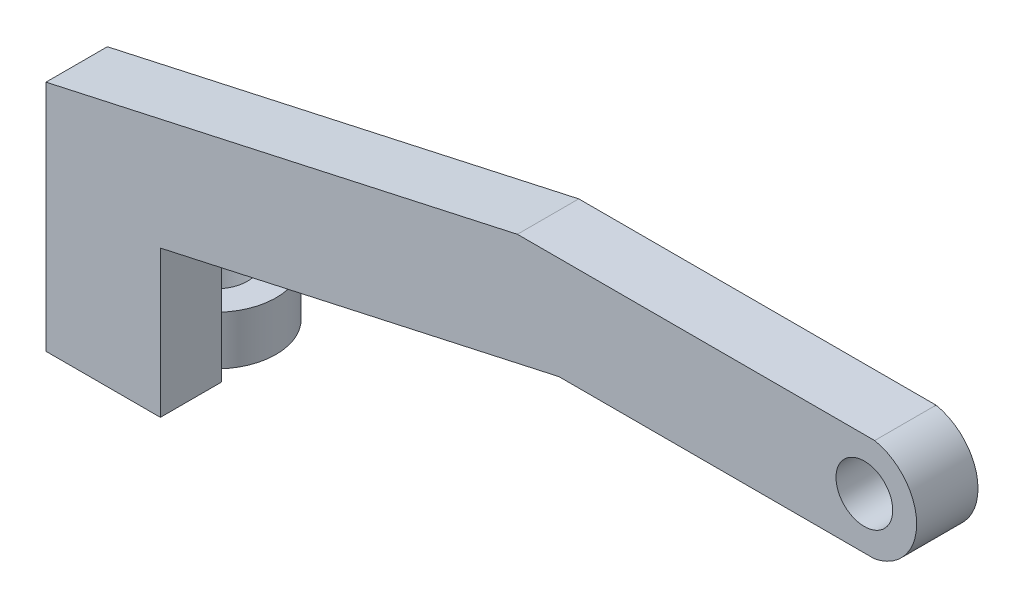
ISO-10303-21;
HEADER;
FILE_DESCRIPTION(('STEP AP214'),'2;1');
FILE_NAME('part.step','',(''),(''),'','','');
FILE_SCHEMA(('AUTOMOTIVE_DESIGN { 1 0 10303 214 1 1 1 1 }'));
ENDSEC;
DATA;
#1=APPLICATION_CONTEXT('core data for automotive mechanical design processes');
#2=APPLICATION_PROTOCOL_DEFINITION('international standard','automotive_design',2000,#1);
#3=PRODUCT_CONTEXT('',#1,'mechanical');
#4=PRODUCT('Part','Part','',(#3));
#5=PRODUCT_RELATED_PRODUCT_CATEGORY('part','',(#4));
#6=PRODUCT_DEFINITION_FORMATION('','',#4);
#7=PRODUCT_DEFINITION_CONTEXT('part definition',#1,'design');
#8=PRODUCT_DEFINITION('design','',#6,#7);
#9=PRODUCT_DEFINITION_SHAPE('','',#8);
#10=(LENGTH_UNIT() NAMED_UNIT(*) SI_UNIT(.MILLI.,.METRE.));
#11=(NAMED_UNIT(*) PLANE_ANGLE_UNIT() SI_UNIT($,.RADIAN.));
#12=(NAMED_UNIT(*) SI_UNIT($,.STERADIAN.) SOLID_ANGLE_UNIT());
#13=UNCERTAINTY_MEASURE_WITH_UNIT(LENGTH_MEASURE(1.E-05),#10,'distance_accuracy_value','');
#14=(GEOMETRIC_REPRESENTATION_CONTEXT(3) GLOBAL_UNCERTAINTY_ASSIGNED_CONTEXT((#13)) GLOBAL_UNIT_ASSIGNED_CONTEXT((#10,
#11,#12)) REPRESENTATION_CONTEXT('',''));
#15=CARTESIAN_POINT('',(0.,0.,0.));
#16=DIRECTION('',(0.,0.,1.));
#17=DIRECTION('',(1.,0.,0.));
#18=AXIS2_PLACEMENT_3D('',#15,#16,#17);
#19=CARTESIAN_POINT('',(0.,-7.55655265754122,0.));
#20=DIRECTION('',(0.,0.,-1.));
#21=DIRECTION('',(-1.,0.,0.));
#22=AXIS2_PLACEMENT_3D('',#19,#20,#21);
#23=PLANE('',#22);
#24=DIRECTION('',(1.,0.,0.));
#25=VECTOR('',#24,1.);
#26=CARTESIAN_POINT('',(0.,-9.55655265754122,0.));
#27=LINE('',#26,#25);
#28=CARTESIAN_POINT('',(4.71581368556064,-9.55655265754122,0.));
#29=VERTEX_POINT('',#28);
#30=CARTESIAN_POINT('',(7.3762383004278,-9.55655265754122,0.));
#31=VERTEX_POINT('',#30);
#32=EDGE_CURVE('E77',#29,#31,#27,.T.);
#33=ORIENTED_EDGE('',*,*,#32,.T.);
#34=DIRECTION('',(0.,-1.,0.));
#35=VECTOR('',#34,1.);
#36=CARTESIAN_POINT('',(7.3762383004278,-7.55655265754122,0.));
#37=LINE('',#36,#35);
#38=CARTESIAN_POINT('',(7.3762383004278,-7.55655265754122,0.));
#39=VERTEX_POINT('',#38);
#40=EDGE_CURVE('E12',#39,#31,#37,.T.);
#41=ORIENTED_EDGE('',*,*,#40,.F.);
#42=DIRECTION('',(1.,0.,0.));
#43=VECTOR('',#42,1.);
#44=CARTESIAN_POINT('',(0.,-7.55655265754122,0.));
#45=LINE('',#44,#43);
#46=CARTESIAN_POINT('',(4.71581368556064,-7.55655265754122,0.));
#47=VERTEX_POINT('',#46);
#48=EDGE_CURVE('E61',#47,#39,#45,.T.);
#49=ORIENTED_EDGE('',*,*,#48,.F.);
#50=DIRECTION('',(0.,-1.,0.));
#51=VECTOR('',#50,1.);
#52=CARTESIAN_POINT('',(4.71581368556064,-7.55655265754122,0.));
#53=LINE('',#52,#51);
#54=EDGE_CURVE('E49',#47,#29,#53,.T.);
#55=ORIENTED_EDGE('',*,*,#54,.T.);
#56=EDGE_LOOP('',(#33,#41,#49,#55));
#57=FACE_BOUND('',#56,.T.);
#58=ADVANCED_FACE('F45',(#57),#23,.F.);
#59=CARTESIAN_POINT('',(6.04602599299422,-7.55655265754122,-2.07740819089074));
#60=DIRECTION('',(0.,-1.,0.));
#61=DIRECTION('',(0.,0.,-1.));
#62=AXIS2_PLACEMENT_3D('',#59,#60,#61);
#63=CYLINDRICAL_SURFACE('',#62,1.3);
#64=CARTESIAN_POINT('',(6.04602599299422,-7.55655265754122,-2.07740819089074));
#65=DIRECTION('',(0.,-1.,0.));
#66=DIRECTION('',(0.,0.,-1.));
#67=AXIS2_PLACEMENT_3D('',#64,#65,#66);
#68=CIRCLE('',#67,1.3);
#69=CARTESIAN_POINT('',(6.04602599299422,-7.55655265754122,-3.37740819089074));
#70=VERTEX_POINT('',#69);
#71=EDGE_CURVE('E82',#70,#70,#68,.F.);
#72=ORIENTED_EDGE('',*,*,#71,.T.);
#73=EDGE_LOOP('',(#72));
#74=FACE_BOUND('',#73,.T.);
#75=CARTESIAN_POINT('',(6.04602599299422,-9.55655265754122,-2.07740819089074));
#76=DIRECTION('',(0.,-1.,0.));
#77=DIRECTION('',(0.,0.,-1.));
#78=AXIS2_PLACEMENT_3D('',#75,#76,#77);
#79=CIRCLE('',#78,1.3);
#80=CARTESIAN_POINT('',(6.04602599299422,-9.55655265754122,-3.37740819089074));
#81=VERTEX_POINT('',#80);
#82=EDGE_CURVE('E79',#81,#81,#79,.F.);
#83=ORIENTED_EDGE('',*,*,#82,.F.);
#84=EDGE_LOOP('',(#83));
#85=FACE_BOUND('',#84,.T.);
#86=ADVANCED_FACE('F47',(#74,#85),#63,.F.);
#87=CARTESIAN_POINT('',(6.04602599299422,-7.55655265754122,-2.07740819089074));
#88=DIRECTION('',(0.,-1.,0.));
#89=DIRECTION('',(0.,0.,-1.));
#90=AXIS2_PLACEMENT_3D('',#87,#88,#89);
#91=CYLINDRICAL_SURFACE('',#90,2.46679743279169);
#92=CARTESIAN_POINT('',(6.04602599299422,-9.55655265754122,-2.07740819089074));
#93=DIRECTION('',(0.,-1.,0.));
#94=DIRECTION('',(0.,0.,-1.));
#95=AXIS2_PLACEMENT_3D('',#92,#93,#94);
#96=CIRCLE('',#95,2.46679743279169);
#97=EDGE_CURVE('E75',#29,#31,#96,.T.);
#98=ORIENTED_EDGE('',*,*,#97,.F.);
#99=ORIENTED_EDGE('',*,*,#54,.F.);
#100=CARTESIAN_POINT('',(6.04602599299422,-7.55655265754122,-2.07740819089074));
#101=DIRECTION('',(0.,-1.,0.));
#102=DIRECTION('',(0.,0.,-1.));
#103=AXIS2_PLACEMENT_3D('',#100,#101,#102);
#104=CIRCLE('',#103,2.46679743279169);
#105=EDGE_CURVE('E76',#47,#39,#104,.T.);
#106=ORIENTED_EDGE('',*,*,#105,.T.);
#107=ORIENTED_EDGE('',*,*,#40,.T.);
#108=EDGE_LOOP('',(#98,#99,#106,#107));
#109=FACE_BOUND('',#108,.T.);
#110=ADVANCED_FACE('F73',(#109),#91,.T.);
#111=CARTESIAN_POINT('',(0.,-7.55655265754122,0.));
#112=DIRECTION('',(0.,-1.,0.));
#113=DIRECTION('',(0.,0.,-1.));
#114=AXIS2_PLACEMENT_3D('',#111,#112,#113);
#115=PLANE('',#114);
#116=ORIENTED_EDGE('',*,*,#71,.F.);
#117=EDGE_LOOP('',(#116));
#118=FACE_BOUND('',#117,.T.);
#119=ORIENTED_EDGE('',*,*,#48,.T.);
#120=ORIENTED_EDGE('',*,*,#105,.F.);
#121=EDGE_LOOP('',(#119,#120));
#122=FACE_BOUND('',#121,.T.);
#123=ADVANCED_FACE('F99',(#118,#122),#115,.F.);
#124=CARTESIAN_POINT('',(0.,-9.55655265754122,0.));
#125=DIRECTION('',(0.,-1.,0.));
#126=DIRECTION('',(0.,0.,-1.));
#127=AXIS2_PLACEMENT_3D('',#124,#125,#126);
#128=PLANE('',#127);
#129=ORIENTED_EDGE('',*,*,#82,.T.);
#130=EDGE_LOOP('',(#129));
#131=FACE_BOUND('',#130,.T.);
#132=ORIENTED_EDGE('',*,*,#32,.F.);
#133=ORIENTED_EDGE('',*,*,#97,.T.);
#134=EDGE_LOOP('',(#132,#133));
#135=FACE_BOUND('',#134,.T.);
#136=ADVANCED_FACE('F81',(#131,#135),#128,.T.);
#137=CLOSED_SHELL('',(#58,#86,#110,#123,#136));
#138=MANIFOLD_SOLID_BREP('B2',#137);
#139=CARTESIAN_POINT('',(37.058865303243,2.08911786543273,2.5));
#140=DIRECTION('',(0.,0.,1.));
#141=DIRECTION('',(1.,0.,0.));
#142=AXIS2_PLACEMENT_3D('',#139,#140,#141);
#143=PLANE('',#142);
#144=DIRECTION('',(0.,-1.,0.));
#145=VECTOR('',#144,1.);
#146=CARTESIAN_POINT('',(3.71581368556064,-0.0565526575412188,2.5));
#147=LINE('',#146,#145);
#148=CARTESIAN_POINT('',(3.71581368556064,-0.0565526575412188,2.5));
#149=VERTEX_POINT('',#148);
#150=CARTESIAN_POINT('',(3.71581368556064,-9.55655265754122,2.5));
#151=VERTEX_POINT('',#150);
#152=EDGE_CURVE('E250',#149,#151,#147,.T.);
#153=ORIENTED_EDGE('',*,*,#152,.T.);
#154=DIRECTION('',(1.,0.,0.));
#155=VECTOR('',#154,1.);
#156=CARTESIAN_POINT('',(3.71581368556064,-9.55655265754122,2.5));
#157=LINE('',#156,#155);
#158=CARTESIAN_POINT('',(8.3762383004278,-9.55655265754122,2.5));
#159=VERTEX_POINT('',#158);
#160=EDGE_CURVE('E198',#151,#159,#157,.T.);
#161=ORIENTED_EDGE('',*,*,#160,.T.);
#162=DIRECTION('',(0.,1.,0.));
#163=VECTOR('',#162,1.);
#164=CARTESIAN_POINT('',(8.3762383004278,-3.580378085646,2.5));
#165=LINE('',#164,#163);
#166=CARTESIAN_POINT('',(8.3762383004278,-3.580378085646,2.5));
#167=VERTEX_POINT('',#166);
#168=EDGE_CURVE('E265',#159,#167,#165,.T.);
#169=ORIENTED_EDGE('',*,*,#168,.T.);
#170=DIRECTION('',(0.976546407621511,0.2153070220906,0.));
#171=VECTOR('',#170,1.);
#172=CARTESIAN_POINT('',(24.6153991207057,0.,2.5));
#173=LINE('',#172,#171);
#174=CARTESIAN_POINT('',(24.6153991207057,0.,2.5));
#175=VERTEX_POINT('',#174);
#176=EDGE_CURVE('E278',#167,#175,#173,.T.);
#177=ORIENTED_EDGE('',*,*,#176,.T.);
#178=DIRECTION('',(1.,0.,0.));
#179=VECTOR('',#178,1.);
#180=CARTESIAN_POINT('',(24.6153991207057,0.,2.5));
#181=LINE('',#180,#179);
#182=CARTESIAN_POINT('',(37.4795741881024,0.,2.5));
#183=VERTEX_POINT('',#182);
#184=EDGE_CURVE('E217',#175,#183,#181,.T.);
#185=ORIENTED_EDGE('',*,*,#184,.T.);
#186=CARTESIAN_POINT('',(37.058865303243,2.08911786543273,2.5));
#187=DIRECTION('',(0.,0.,1.));
#188=DIRECTION('',(1.,0.,0.));
#189=AXIS2_PLACEMENT_3D('',#186,#187,#188);
#190=CIRCLE('',#189,2.13105828673685);
#191=CARTESIAN_POINT('',(37.4795741881024,4.17823573086546,2.5));
#192=VERTEX_POINT('',#191);
#193=EDGE_CURVE('E211',#183,#192,#190,.T.);
#194=ORIENTED_EDGE('',*,*,#193,.T.);
#195=DIRECTION('',(-1.,0.,0.));
#196=VECTOR('',#195,1.);
#197=CARTESIAN_POINT('',(37.4795741881024,4.17823573086546,2.5));
#198=LINE('',#197,#196);
#199=CARTESIAN_POINT('',(22.9231175049208,4.17823573086546,2.5));
#200=VERTEX_POINT('',#199);
#201=EDGE_CURVE('E215',#192,#200,#198,.T.);
#202=ORIENTED_EDGE('',*,*,#201,.T.);
#203=DIRECTION('',(-0.976546407621511,-0.2153070220906,0.));
#204=VECTOR('',#203,1.);
#205=CARTESIAN_POINT('',(3.71581368556064,-0.0565526575412188,2.5));
#206=LINE('',#205,#204);
#207=EDGE_CURVE('E155',#200,#149,#206,.T.);
#208=ORIENTED_EDGE('',*,*,#207,.T.);
#209=EDGE_LOOP('',(#153,#161,#169,#177,#185,#194,#202,#208));
#210=FACE_BOUND('',#209,.T.);
#211=CARTESIAN_POINT('',(37.058865303243,2.08911786543273,2.5));
#212=DIRECTION('',(0.,0.,1.));
#213=DIRECTION('',(1.,0.,0.));
#214=AXIS2_PLACEMENT_3D('',#211,#212,#213);
#215=CIRCLE('',#214,1.15512798864185);
#216=CARTESIAN_POINT('',(38.2139932918849,2.08911786543273,2.5));
#217=VERTEX_POINT('',#216);
#218=EDGE_CURVE('E239',#217,#217,#215,.T.);
#219=ORIENTED_EDGE('',*,*,#218,.F.);
#220=EDGE_LOOP('',(#219));
#221=FACE_BOUND('',#220,.T.);
#222=ADVANCED_FACE('F138',(#210,#221),#143,.T.);
#223=CARTESIAN_POINT('',(37.058865303243,2.08911786543273,0.));
#224=DIRECTION('',(0.,0.,1.));
#225=DIRECTION('',(1.,0.,0.));
#226=AXIS2_PLACEMENT_3D('',#223,#224,#225);
#227=PLANE('',#226);
#228=DIRECTION('',(0.,-1.,0.));
#229=VECTOR('',#228,1.);
#230=CARTESIAN_POINT('',(3.71581368556064,-0.0565526575412188,0.));
#231=LINE('',#230,#229);
#232=CARTESIAN_POINT('',(3.71581368556064,-0.0565526575412188,0.));
#233=VERTEX_POINT('',#232);
#234=CARTESIAN_POINT('',(3.71581368556064,-9.55655265754122,0.));
#235=VERTEX_POINT('',#234);
#236=EDGE_CURVE('E235',#233,#235,#231,.T.);
#237=ORIENTED_EDGE('',*,*,#236,.F.);
#238=DIRECTION('',(-0.976546407621511,-0.2153070220906,0.));
#239=VECTOR('',#238,1.);
#240=CARTESIAN_POINT('',(3.71581368556064,-0.0565526575412188,0.));
#241=LINE('',#240,#239);
#242=CARTESIAN_POINT('',(22.9231175049208,4.17823573086546,0.));
#243=VERTEX_POINT('',#242);
#244=EDGE_CURVE('E190',#243,#233,#241,.T.);
#245=ORIENTED_EDGE('',*,*,#244,.F.);
#246=DIRECTION('',(-1.,0.,0.));
#247=VECTOR('',#246,1.);
#248=CARTESIAN_POINT('',(37.4795741881024,4.17823573086546,0.));
#249=LINE('',#248,#247);
#250=CARTESIAN_POINT('',(37.4795741881024,4.17823573086546,0.));
#251=VERTEX_POINT('',#250);
#252=EDGE_CURVE('E184',#251,#243,#249,.T.);
#253=ORIENTED_EDGE('',*,*,#252,.F.);
#254=CARTESIAN_POINT('',(37.058865303243,2.08911786543273,0.));
#255=DIRECTION('',(0.,0.,1.));
#256=DIRECTION('',(1.,0.,0.));
#257=AXIS2_PLACEMENT_3D('',#254,#255,#256);
#258=CIRCLE('',#257,2.13105828673685);
#259=CARTESIAN_POINT('',(37.4795741881024,0.,0.));
#260=VERTEX_POINT('',#259);
#261=EDGE_CURVE('E225',#260,#251,#258,.T.);
#262=ORIENTED_EDGE('',*,*,#261,.F.);
#263=DIRECTION('',(1.,0.,0.));
#264=VECTOR('',#263,1.);
#265=CARTESIAN_POINT('',(24.6153991207057,0.,0.));
#266=LINE('',#265,#264);
#267=CARTESIAN_POINT('',(24.6153991207057,0.,0.));
#268=VERTEX_POINT('',#267);
#269=EDGE_CURVE('E245',#268,#260,#266,.T.);
#270=ORIENTED_EDGE('',*,*,#269,.F.);
#271=DIRECTION('',(0.976546407621511,0.2153070220906,0.));
#272=VECTOR('',#271,1.);
#273=CARTESIAN_POINT('',(24.6153991207057,0.,0.));
#274=LINE('',#273,#272);
#275=CARTESIAN_POINT('',(8.3762383004278,-3.580378085646,0.));
#276=VERTEX_POINT('',#275);
#277=EDGE_CURVE('E243',#276,#268,#274,.T.);
#278=ORIENTED_EDGE('',*,*,#277,.F.);
#279=DIRECTION('',(0.,1.,0.));
#280=VECTOR('',#279,1.);
#281=CARTESIAN_POINT('',(8.3762383004278,-3.580378085646,0.));
#282=LINE('',#281,#280);
#283=CARTESIAN_POINT('',(8.3762383004278,-9.55655265754122,0.));
#284=VERTEX_POINT('',#283);
#285=EDGE_CURVE('E241',#284,#276,#282,.T.);
#286=ORIENTED_EDGE('',*,*,#285,.F.);
#287=DIRECTION('',(1.,0.,0.));
#288=VECTOR('',#287,1.);
#289=CARTESIAN_POINT('',(3.71581368556064,-9.55655265754122,0.));
#290=LINE('',#289,#288);
#291=EDGE_CURVE('E238',#235,#284,#290,.T.);
#292=ORIENTED_EDGE('',*,*,#291,.F.);
#293=EDGE_LOOP('',(#237,#245,#253,#262,#270,#278,#286,#292));
#294=FACE_BOUND('',#293,.T.);
#295=CARTESIAN_POINT('',(37.058865303243,2.08911786543273,0.));
#296=DIRECTION('',(0.,0.,1.));
#297=DIRECTION('',(1.,0.,0.));
#298=AXIS2_PLACEMENT_3D('',#295,#296,#297);
#299=CIRCLE('',#298,1.15512798864185);
#300=CARTESIAN_POINT('',(38.2139932918849,2.08911786543273,0.));
#301=VERTEX_POINT('',#300);
#302=EDGE_CURVE('E284',#301,#301,#299,.T.);
#303=ORIENTED_EDGE('',*,*,#302,.T.);
#304=EDGE_LOOP('',(#303));
#305=FACE_BOUND('',#304,.T.);
#306=ADVANCED_FACE('F269',(#294,#305),#227,.F.);
#307=CARTESIAN_POINT('',(3.71581368556064,-0.0565526575412188,2.5));
#308=DIRECTION('',(1.,0.,0.));
#309=DIRECTION('',(0.,1.,0.));
#310=AXIS2_PLACEMENT_3D('',#307,#308,#309);
#311=PLANE('',#310);
#312=ORIENTED_EDGE('',*,*,#236,.T.);
#313=DIRECTION('',(0.,0.,-1.));
#314=VECTOR('',#313,1.);
#315=CARTESIAN_POINT('',(3.71581368556064,-9.55655265754122,2.5));
#316=LINE('',#315,#314);
#317=EDGE_CURVE('E43',#151,#235,#316,.T.);
#318=ORIENTED_EDGE('',*,*,#317,.F.);
#319=ORIENTED_EDGE('',*,*,#152,.F.);
#320=DIRECTION('',(0.,0.,-1.));
#321=VECTOR('',#320,1.);
#322=CARTESIAN_POINT('',(3.71581368556064,-0.0565526575412188,2.5));
#323=LINE('',#322,#321);
#324=EDGE_CURVE('E231',#149,#233,#323,.T.);
#325=ORIENTED_EDGE('',*,*,#324,.T.);
#326=EDGE_LOOP('',(#312,#318,#319,#325));
#327=FACE_BOUND('',#326,.T.);
#328=ADVANCED_FACE('F140',(#327),#311,.F.);
#329=CARTESIAN_POINT('',(3.71581368556064,-9.55655265754122,2.5));
#330=DIRECTION('',(0.,1.,0.));
#331=DIRECTION('',(0.,0.,1.));
#332=AXIS2_PLACEMENT_3D('',#329,#330,#331);
#333=PLANE('',#332);
#334=ORIENTED_EDGE('',*,*,#291,.T.);
#335=DIRECTION('',(0.,0.,-1.));
#336=VECTOR('',#335,1.);
#337=CARTESIAN_POINT('',(8.3762383004278,-9.55655265754122,2.5));
#338=LINE('',#337,#336);
#339=EDGE_CURVE('E147',#159,#284,#338,.T.);
#340=ORIENTED_EDGE('',*,*,#339,.F.);
#341=ORIENTED_EDGE('',*,*,#160,.F.);
#342=ORIENTED_EDGE('',*,*,#317,.T.);
#343=EDGE_LOOP('',(#334,#340,#341,#342));
#344=FACE_BOUND('',#343,.T.);
#345=ADVANCED_FACE('F312',(#344),#333,.F.);
#346=CARTESIAN_POINT('',(8.3762383004278,-3.580378085646,2.5));
#347=DIRECTION('',(-1.,0.,0.));
#348=DIRECTION('',(0.,-1.,0.));
#349=AXIS2_PLACEMENT_3D('',#346,#347,#348);
#350=PLANE('',#349);
#351=ORIENTED_EDGE('',*,*,#285,.T.);
#352=DIRECTION('',(0.,0.,-1.));
#353=VECTOR('',#352,1.);
#354=CARTESIAN_POINT('',(8.3762383004278,-3.580378085646,2.5));
#355=LINE('',#354,#353);
#356=EDGE_CURVE('E257',#167,#276,#355,.T.);
#357=ORIENTED_EDGE('',*,*,#356,.F.);
#358=ORIENTED_EDGE('',*,*,#168,.F.);
#359=ORIENTED_EDGE('',*,*,#339,.T.);
#360=EDGE_LOOP('',(#351,#357,#358,#359));
#361=FACE_BOUND('',#360,.T.);
#362=ADVANCED_FACE('F263',(#361),#350,.F.);
#363=CARTESIAN_POINT('',(24.6153991207057,0.,2.5));
#364=DIRECTION('',(-0.2153070220906,0.976546407621511,0.));
#365=DIRECTION('',(-0.976546407621511,-0.2153070220906,0.));
#366=AXIS2_PLACEMENT_3D('',#363,#364,#365);
#367=PLANE('',#366);
#368=ORIENTED_EDGE('',*,*,#277,.T.);
#369=DIRECTION('',(0.,0.,-1.));
#370=VECTOR('',#369,1.);
#371=CARTESIAN_POINT('',(24.6153991207057,0.,2.5));
#372=LINE('',#371,#370);
#373=EDGE_CURVE('E254',#175,#268,#372,.T.);
#374=ORIENTED_EDGE('',*,*,#373,.F.);
#375=ORIENTED_EDGE('',*,*,#176,.F.);
#376=ORIENTED_EDGE('',*,*,#356,.T.);
#377=EDGE_LOOP('',(#368,#374,#375,#376));
#378=FACE_BOUND('',#377,.T.);
#379=ADVANCED_FACE('F274',(#378),#367,.F.);
#380=CARTESIAN_POINT('',(24.6153991207057,0.,2.5));
#381=DIRECTION('',(0.,1.,0.));
#382=DIRECTION('',(-1.,0.,0.));
#383=AXIS2_PLACEMENT_3D('',#380,#381,#382);
#384=PLANE('',#383);
#385=ORIENTED_EDGE('',*,*,#269,.T.);
#386=DIRECTION('',(0.,0.,-1.));
#387=VECTOR('',#386,1.);
#388=CARTESIAN_POINT('',(37.4795741881024,0.,2.5));
#389=LINE('',#388,#387);
#390=EDGE_CURVE('E226',#183,#260,#389,.T.);
#391=ORIENTED_EDGE('',*,*,#390,.F.);
#392=ORIENTED_EDGE('',*,*,#184,.F.);
#393=ORIENTED_EDGE('',*,*,#373,.T.);
#394=EDGE_LOOP('',(#385,#391,#392,#393));
#395=FACE_BOUND('',#394,.T.);
#396=ADVANCED_FACE('F277',(#395),#384,.F.);
#397=CARTESIAN_POINT('',(37.058865303243,2.08911786543273,2.5));
#398=DIRECTION('',(0.,0.,-1.));
#399=DIRECTION('',(-1.,0.,0.));
#400=AXIS2_PLACEMENT_3D('',#397,#398,#399);
#401=CYLINDRICAL_SURFACE('',#400,2.13105828673685);
#402=ORIENTED_EDGE('',*,*,#261,.T.);
#403=DIRECTION('',(0.,0.,-1.));
#404=VECTOR('',#403,1.);
#405=CARTESIAN_POINT('',(37.4795741881024,4.17823573086546,2.5));
#406=LINE('',#405,#404);
#407=EDGE_CURVE('E222',#192,#251,#406,.T.);
#408=ORIENTED_EDGE('',*,*,#407,.F.);
#409=ORIENTED_EDGE('',*,*,#193,.F.);
#410=ORIENTED_EDGE('',*,*,#390,.T.);
#411=EDGE_LOOP('',(#402,#408,#409,#410));
#412=FACE_BOUND('',#411,.T.);
#413=ADVANCED_FACE('F223',(#412),#401,.T.);
#414=CARTESIAN_POINT('',(37.4795741881024,4.17823573086546,2.5));
#415=DIRECTION('',(0.,-1.,0.));
#416=DIRECTION('',(0.,0.,-1.));
#417=AXIS2_PLACEMENT_3D('',#414,#415,#416);
#418=PLANE('',#417);
#419=ORIENTED_EDGE('',*,*,#252,.T.);
#420=DIRECTION('',(0.,0.,-1.));
#421=VECTOR('',#420,1.);
#422=CARTESIAN_POINT('',(22.9231175049208,4.17823573086546,2.5));
#423=LINE('',#422,#421);
#424=EDGE_CURVE('E227',#200,#243,#423,.T.);
#425=ORIENTED_EDGE('',*,*,#424,.F.);
#426=ORIENTED_EDGE('',*,*,#201,.F.);
#427=ORIENTED_EDGE('',*,*,#407,.T.);
#428=EDGE_LOOP('',(#419,#425,#426,#427));
#429=FACE_BOUND('',#428,.T.);
#430=ADVANCED_FACE('F229',(#429),#418,.F.);
#431=CARTESIAN_POINT('',(3.71581368556064,-0.0565526575412188,2.5));
#432=DIRECTION('',(0.2153070220906,-0.976546407621511,0.));
#433=DIRECTION('',(0.976546407621511,0.2153070220906,0.));
#434=AXIS2_PLACEMENT_3D('',#431,#432,#433);
#435=PLANE('',#434);
#436=ORIENTED_EDGE('',*,*,#244,.T.);
#437=ORIENTED_EDGE('',*,*,#324,.F.);
#438=ORIENTED_EDGE('',*,*,#207,.F.);
#439=ORIENTED_EDGE('',*,*,#424,.T.);
#440=EDGE_LOOP('',(#436,#437,#438,#439));
#441=FACE_BOUND('',#440,.T.);
#442=ADVANCED_FACE('F300',(#441),#435,.F.);
#443=CARTESIAN_POINT('',(37.058865303243,2.08911786543273,2.5));
#444=DIRECTION('',(0.,0.,-1.));
#445=DIRECTION('',(-1.,0.,0.));
#446=AXIS2_PLACEMENT_3D('',#443,#444,#445);
#447=CYLINDRICAL_SURFACE('',#446,1.15512798864185);
#448=ORIENTED_EDGE('',*,*,#218,.T.);
#449=EDGE_LOOP('',(#448));
#450=FACE_BOUND('',#449,.T.);
#451=ORIENTED_EDGE('',*,*,#302,.F.);
#452=EDGE_LOOP('',(#451));
#453=FACE_BOUND('',#452,.T.);
#454=ADVANCED_FACE('F290',(#450,#453),#447,.F.);
#455=CLOSED_SHELL('',(#222,#306,#328,#345,#362,#379,#396,#413,#430,#442,#454));
#456=MANIFOLD_SOLID_BREP('B6',#455);
#457=ADVANCED_BREP_SHAPE_REPRESENTATION('',(#18,#138,#456),#14);
#458=SHAPE_DEFINITION_REPRESENTATION(#9,#457);
ENDSEC;
END-ISO-10303-21;
